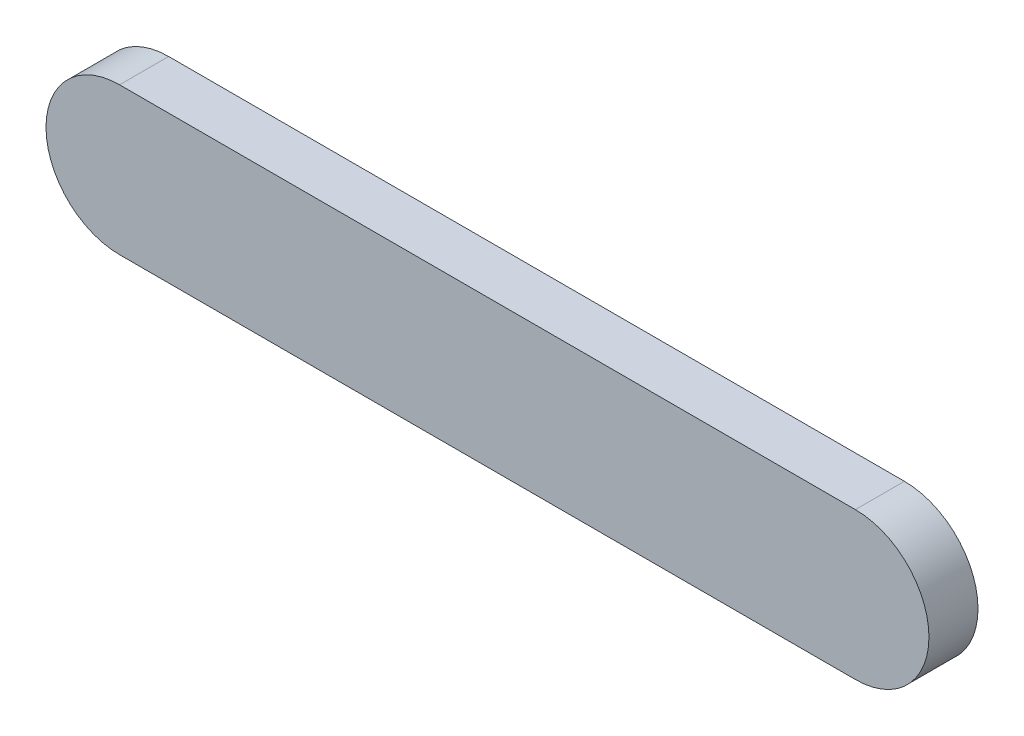
ISO-10303-21;
HEADER;
FILE_DESCRIPTION(('STEP AP214'),'2;1');
FILE_NAME('part.step','',(''),(''),'','','');
FILE_SCHEMA(('AUTOMOTIVE_DESIGN { 1 0 10303 214 1 1 1 1 }'));
ENDSEC;
DATA;
#1=APPLICATION_CONTEXT('core data for automotive mechanical design processes');
#2=APPLICATION_PROTOCOL_DEFINITION('international standard','automotive_design',2000,#1);
#3=PRODUCT_CONTEXT('',#1,'mechanical');
#4=PRODUCT('Part','Part','',(#3));
#5=PRODUCT_RELATED_PRODUCT_CATEGORY('part','',(#4));
#6=PRODUCT_DEFINITION_FORMATION('','',#4);
#7=PRODUCT_DEFINITION_CONTEXT('part definition',#1,'design');
#8=PRODUCT_DEFINITION('design','',#6,#7);
#9=PRODUCT_DEFINITION_SHAPE('','',#8);
#10=(LENGTH_UNIT() NAMED_UNIT(*) SI_UNIT(.MILLI.,.METRE.));
#11=(NAMED_UNIT(*) PLANE_ANGLE_UNIT() SI_UNIT($,.RADIAN.));
#12=(NAMED_UNIT(*) SI_UNIT($,.STERADIAN.) SOLID_ANGLE_UNIT());
#13=UNCERTAINTY_MEASURE_WITH_UNIT(LENGTH_MEASURE(1.E-05),#10,'distance_accuracy_value','');
#14=(GEOMETRIC_REPRESENTATION_CONTEXT(3) GLOBAL_UNCERTAINTY_ASSIGNED_CONTEXT((#13)) GLOBAL_UNIT_ASSIGNED_CONTEXT((#10,
#11,#12)) REPRESENTATION_CONTEXT('',''));
#15=CARTESIAN_POINT('',(0.,0.,0.));
#16=DIRECTION('',(0.,0.,1.));
#17=DIRECTION('',(1.,0.,0.));
#18=AXIS2_PLACEMENT_3D('',#15,#16,#17);
#19=CARTESIAN_POINT('',(0.,0.,10.));
#20=DIRECTION('',(0.,0.,-1.));
#21=DIRECTION('',(-1.,0.,0.));
#22=AXIS2_PLACEMENT_3D('',#19,#20,#21);
#23=CYLINDRICAL_SURFACE('',#22,15.);
#24=CARTESIAN_POINT('',(0.,0.,0.));
#25=DIRECTION('',(0.,0.,1.));
#26=DIRECTION('',(1.,0.,0.));
#27=AXIS2_PLACEMENT_3D('',#24,#25,#26);
#28=CIRCLE('',#27,15.);
#29=CARTESIAN_POINT('',(0.,15.,0.));
#30=VERTEX_POINT('',#29);
#31=CARTESIAN_POINT('',(0.,-15.,0.));
#32=VERTEX_POINT('',#31);
#33=EDGE_CURVE('E95',#30,#32,#28,.T.);
#34=ORIENTED_EDGE('',*,*,#33,.T.);
#35=DIRECTION('',(0.,0.,-1.));
#36=VECTOR('',#35,1.);
#37=CARTESIAN_POINT('',(0.,-15.,10.));
#38=LINE('',#37,#36);
#39=CARTESIAN_POINT('',(0.,-15.,10.));
#40=VERTEX_POINT('',#39);
#41=EDGE_CURVE('E11',#40,#32,#38,.T.);
#42=ORIENTED_EDGE('',*,*,#41,.F.);
#43=CARTESIAN_POINT('',(0.,0.,10.));
#44=DIRECTION('',(0.,0.,1.));
#45=DIRECTION('',(1.,0.,0.));
#46=AXIS2_PLACEMENT_3D('',#43,#44,#45);
#47=CIRCLE('',#46,15.);
#48=CARTESIAN_POINT('',(0.,15.,10.));
#49=VERTEX_POINT('',#48);
#50=EDGE_CURVE('E83',#49,#40,#47,.T.);
#51=ORIENTED_EDGE('',*,*,#50,.F.);
#52=DIRECTION('',(0.,0.,-1.));
#53=VECTOR('',#52,1.);
#54=CARTESIAN_POINT('',(0.,15.,10.));
#55=LINE('',#54,#53);
#56=EDGE_CURVE('E91',#49,#30,#55,.T.);
#57=ORIENTED_EDGE('',*,*,#56,.T.);
#58=EDGE_LOOP('',(#34,#42,#51,#57));
#59=FACE_BOUND('',#58,.T.);
#60=ADVANCED_FACE('F32',(#59),#23,.T.);
#61=CARTESIAN_POINT('',(150.,-15.,10.));
#62=DIRECTION('',(0.,1.,0.));
#63=DIRECTION('',(-1.,0.,0.));
#64=AXIS2_PLACEMENT_3D('',#61,#62,#63);
#65=PLANE('',#64);
#66=DIRECTION('',(1.,0.,0.));
#67=VECTOR('',#66,1.);
#68=CARTESIAN_POINT('',(150.,-15.,0.));
#69=LINE('',#68,#67);
#70=CARTESIAN_POINT('',(150.,-15.,0.));
#71=VERTEX_POINT('',#70);
#72=EDGE_CURVE('E87',#32,#71,#69,.T.);
#73=ORIENTED_EDGE('',*,*,#72,.T.);
#74=DIRECTION('',(0.,0.,-1.));
#75=VECTOR('',#74,1.);
#76=CARTESIAN_POINT('',(150.,-15.,10.));
#77=LINE('',#76,#75);
#78=CARTESIAN_POINT('',(150.,-15.,10.));
#79=VERTEX_POINT('',#78);
#80=EDGE_CURVE('E40',#79,#71,#77,.T.);
#81=ORIENTED_EDGE('',*,*,#80,.F.);
#82=DIRECTION('',(1.,0.,0.));
#83=VECTOR('',#82,1.);
#84=CARTESIAN_POINT('',(150.,-15.,10.));
#85=LINE('',#84,#83);
#86=EDGE_CURVE('E78',#40,#79,#85,.T.);
#87=ORIENTED_EDGE('',*,*,#86,.F.);
#88=ORIENTED_EDGE('',*,*,#41,.T.);
#89=EDGE_LOOP('',(#73,#81,#87,#88));
#90=FACE_BOUND('',#89,.T.);
#91=ADVANCED_FACE('F86',(#90),#65,.F.);
#92=CARTESIAN_POINT('',(150.,0.,10.));
#93=DIRECTION('',(0.,0.,-1.));
#94=DIRECTION('',(-1.,0.,0.));
#95=AXIS2_PLACEMENT_3D('',#92,#93,#94);
#96=CYLINDRICAL_SURFACE('',#95,15.);
#97=CARTESIAN_POINT('',(150.,0.,0.));
#98=DIRECTION('',(0.,0.,1.));
#99=DIRECTION('',(1.,0.,0.));
#100=AXIS2_PLACEMENT_3D('',#97,#98,#99);
#101=CIRCLE('',#100,15.);
#102=CARTESIAN_POINT('',(150.,15.,0.));
#103=VERTEX_POINT('',#102);
#104=EDGE_CURVE('E65',#71,#103,#101,.T.);
#105=ORIENTED_EDGE('',*,*,#104,.T.);
#106=DIRECTION('',(0.,0.,-1.));
#107=VECTOR('',#106,1.);
#108=CARTESIAN_POINT('',(150.,15.,10.));
#109=LINE('',#108,#107);
#110=CARTESIAN_POINT('',(150.,15.,10.));
#111=VERTEX_POINT('',#110);
#112=EDGE_CURVE('E88',#111,#103,#109,.T.);
#113=ORIENTED_EDGE('',*,*,#112,.F.);
#114=CARTESIAN_POINT('',(150.,0.,10.));
#115=DIRECTION('',(0.,0.,1.));
#116=DIRECTION('',(1.,0.,0.));
#117=AXIS2_PLACEMENT_3D('',#114,#115,#116);
#118=CIRCLE('',#117,15.);
#119=EDGE_CURVE('E81',#79,#111,#118,.T.);
#120=ORIENTED_EDGE('',*,*,#119,.F.);
#121=ORIENTED_EDGE('',*,*,#80,.T.);
#122=EDGE_LOOP('',(#105,#113,#120,#121));
#123=FACE_BOUND('',#122,.T.);
#124=ADVANCED_FACE('F89',(#123),#96,.T.);
#125=CARTESIAN_POINT('',(0.,15.,10.));
#126=DIRECTION('',(0.,-1.,0.));
#127=DIRECTION('',(1.,0.,0.));
#128=AXIS2_PLACEMENT_3D('',#125,#126,#127);
#129=PLANE('',#128);
#130=DIRECTION('',(-1.,0.,0.));
#131=VECTOR('',#130,1.);
#132=CARTESIAN_POINT('',(0.,15.,0.));
#133=LINE('',#132,#131);
#134=EDGE_CURVE('E71',#103,#30,#133,.T.);
#135=ORIENTED_EDGE('',*,*,#134,.T.);
#136=ORIENTED_EDGE('',*,*,#56,.F.);
#137=DIRECTION('',(-1.,0.,0.));
#138=VECTOR('',#137,1.);
#139=CARTESIAN_POINT('',(0.,15.,10.));
#140=LINE('',#139,#138);
#141=EDGE_CURVE('E48',#111,#49,#140,.T.);
#142=ORIENTED_EDGE('',*,*,#141,.F.);
#143=ORIENTED_EDGE('',*,*,#112,.T.);
#144=EDGE_LOOP('',(#135,#136,#142,#143));
#145=FACE_BOUND('',#144,.T.);
#146=ADVANCED_FACE('F102',(#145),#129,.F.);
#147=CARTESIAN_POINT('',(0.,0.,10.));
#148=DIRECTION('',(0.,0.,1.));
#149=DIRECTION('',(1.,0.,0.));
#150=AXIS2_PLACEMENT_3D('',#147,#148,#149);
#151=PLANE('',#150);
#152=ORIENTED_EDGE('',*,*,#50,.T.);
#153=ORIENTED_EDGE('',*,*,#86,.T.);
#154=ORIENTED_EDGE('',*,*,#119,.T.);
#155=ORIENTED_EDGE('',*,*,#141,.T.);
#156=EDGE_LOOP('',(#152,#153,#154,#155));
#157=FACE_BOUND('',#156,.T.);
#158=ADVANCED_FACE('F79',(#157),#151,.T.);
#159=CARTESIAN_POINT('',(0.,0.,0.));
#160=DIRECTION('',(0.,0.,1.));
#161=DIRECTION('',(1.,0.,0.));
#162=AXIS2_PLACEMENT_3D('',#159,#160,#161);
#163=PLANE('',#162);
#164=ORIENTED_EDGE('',*,*,#33,.F.);
#165=ORIENTED_EDGE('',*,*,#134,.F.);
#166=ORIENTED_EDGE('',*,*,#104,.F.);
#167=ORIENTED_EDGE('',*,*,#72,.F.);
#168=EDGE_LOOP('',(#164,#165,#166,#167));
#169=FACE_BOUND('',#168,.T.);
#170=ADVANCED_FACE('F105',(#169),#163,.F.);
#171=CLOSED_SHELL('',(#60,#91,#124,#146,#158,#170));
#172=MANIFOLD_SOLID_BREP('B2',#171);
#173=ADVANCED_BREP_SHAPE_REPRESENTATION('',(#18,#172),#14);
#174=SHAPE_DEFINITION_REPRESENTATION(#9,#173);
ENDSEC;
END-ISO-10303-21;
